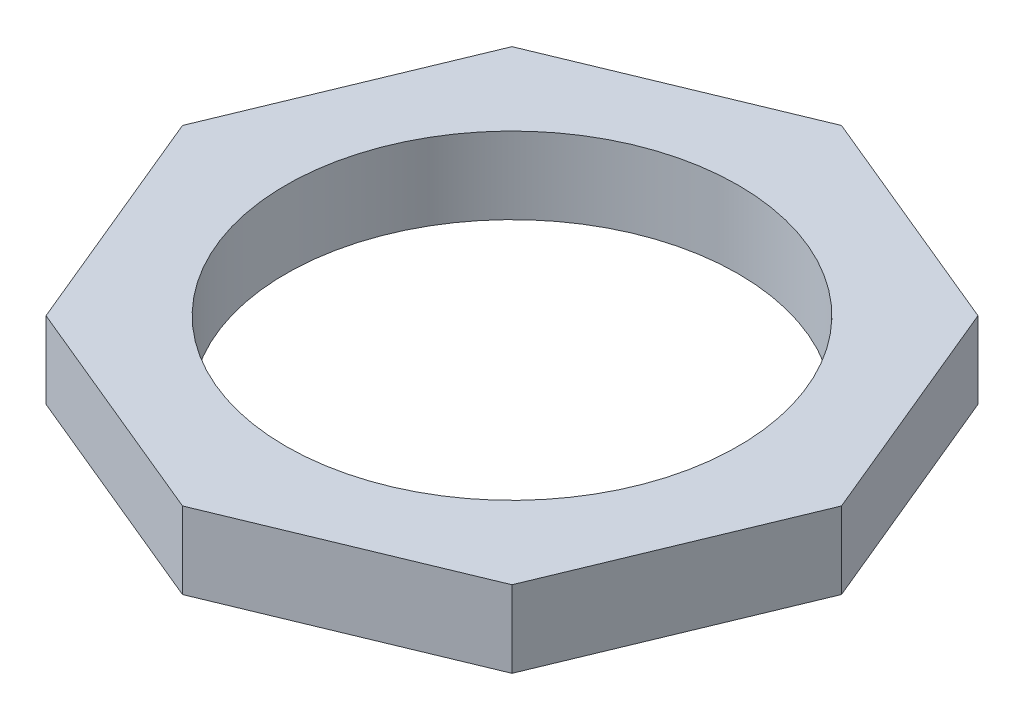
ISO-10303-21;
HEADER;
FILE_DESCRIPTION(('STEP AP214'),'2;1');
FILE_NAME('part.step','',(''),(''),'','','');
FILE_SCHEMA(('AUTOMOTIVE_DESIGN { 1 0 10303 214 1 1 1 1 }'));
ENDSEC;
DATA;
#1=APPLICATION_CONTEXT('core data for automotive mechanical design processes');
#2=APPLICATION_PROTOCOL_DEFINITION('international standard','automotive_design',2000,#1);
#3=PRODUCT_CONTEXT('',#1,'mechanical');
#4=PRODUCT('Part','Part','',(#3));
#5=PRODUCT_RELATED_PRODUCT_CATEGORY('part','',(#4));
#6=PRODUCT_DEFINITION_FORMATION('','',#4);
#7=PRODUCT_DEFINITION_CONTEXT('part definition',#1,'design');
#8=PRODUCT_DEFINITION('design','',#6,#7);
#9=PRODUCT_DEFINITION_SHAPE('','',#8);
#10=(LENGTH_UNIT() NAMED_UNIT(*) SI_UNIT(.MILLI.,.METRE.));
#11=(NAMED_UNIT(*) PLANE_ANGLE_UNIT() SI_UNIT($,.RADIAN.));
#12=(NAMED_UNIT(*) SI_UNIT($,.STERADIAN.) SOLID_ANGLE_UNIT());
#13=UNCERTAINTY_MEASURE_WITH_UNIT(LENGTH_MEASURE(1.E-05),#10,'distance_accuracy_value','');
#14=(GEOMETRIC_REPRESENTATION_CONTEXT(3) GLOBAL_UNCERTAINTY_ASSIGNED_CONTEXT((#13)) GLOBAL_UNIT_ASSIGNED_CONTEXT((#10,
#11,#12)) REPRESENTATION_CONTEXT('',''));
#15=CARTESIAN_POINT('',(0.,0.,0.));
#16=DIRECTION('',(0.,0.,1.));
#17=DIRECTION('',(1.,0.,0.));
#18=AXIS2_PLACEMENT_3D('',#15,#16,#17);
#19=CARTESIAN_POINT('',(0.,14.3,0.));
#20=DIRECTION('',(0.,1.,0.));
#21=DIRECTION('',(0.,0.,1.));
#22=AXIS2_PLACEMENT_3D('',#19,#20,#21);
#23=PLANE('',#22);
#24=DIRECTION('',(0.382683432365072,0.,-0.923879532511294));
#25=VECTOR('',#24,1.);
#26=CARTESIAN_POINT('',(43.4223380280315,14.3,39.9165208007097));
#27=LINE('',#26,#25);
#28=CARTESIAN_POINT('',(43.4223380280315,14.3,39.9165208007097));
#29=VERTEX_POINT('',#28);
#30=CARTESIAN_POINT('',(61.4084593491896,14.3,-3.50581722732055));
#31=VERTEX_POINT('',#30);
#32=EDGE_CURVE('E151',#29,#31,#27,.T.);
#33=ORIENTED_EDGE('',*,*,#32,.T.);
#34=DIRECTION('',(-0.38268343236509,0.,-0.923879532511286));
#35=VECTOR('',#34,1.);
#36=CARTESIAN_POINT('',(61.4084593491896,14.3,-3.50581722732055));
#37=LINE('',#36,#35);
#38=CARTESIAN_POINT('',(43.4223380280303,14.3,-46.9281552553511));
#39=VERTEX_POINT('',#38);
#40=EDGE_CURVE('E99',#31,#39,#37,.T.);
#41=ORIENTED_EDGE('',*,*,#40,.T.);
#42=DIRECTION('',(-0.92387953251129,0.,-0.382683432365081));
#43=VECTOR('',#42,1.);
#44=CARTESIAN_POINT('',(43.4223380280303,14.3,-46.9281552553511));
#45=LINE('',#44,#43);
#46=CARTESIAN_POINT('',(-9.74918016590928E-13,14.3,-64.9142765765101));
#47=VERTEX_POINT('',#46);
#48=EDGE_CURVE('E166',#39,#47,#45,.T.);
#49=ORIENTED_EDGE('',*,*,#48,.T.);
#50=DIRECTION('',(-0.923879532511282,0.,0.382683432365102));
#51=VECTOR('',#50,1.);
#52=CARTESIAN_POINT('',(-9.74918016590928E-13,14.3,-64.9142765765101));
#53=LINE('',#52,#51);
#54=CARTESIAN_POINT('',(-43.4223380280312,14.3,-46.9281552553504));
#55=VERTEX_POINT('',#54);
#56=EDGE_CURVE('E179',#47,#55,#53,.T.);
#57=ORIENTED_EDGE('',*,*,#56,.T.);
#58=DIRECTION('',(-0.382683432365082,0.,0.92387953251129));
#59=VECTOR('',#58,1.);
#60=CARTESIAN_POINT('',(-43.4223380280312,14.3,-46.9281552553504));
#61=LINE('',#60,#59);
#62=CARTESIAN_POINT('',(-61.4084593491898,14.3,-3.50581722732037));
#63=VERTEX_POINT('',#62);
#64=EDGE_CURVE('E118',#55,#63,#61,.T.);
#65=ORIENTED_EDGE('',*,*,#64,.T.);
#66=DIRECTION('',(0.382683432365091,0.,0.923879532511286));
#67=VECTOR('',#66,1.);
#68=CARTESIAN_POINT('',(-61.4084593491898,14.3,-3.50581722732037));
#69=LINE('',#68,#67);
#70=CARTESIAN_POINT('',(-43.4223380280305,14.3,39.9165208007101));
#71=VERTEX_POINT('',#70);
#72=EDGE_CURVE('E112',#63,#71,#69,.T.);
#73=ORIENTED_EDGE('',*,*,#72,.T.);
#74=DIRECTION('',(0.923879532511287,0.,0.38268343236509));
#75=VECTOR('',#74,1.);
#76=CARTESIAN_POINT('',(-43.4223380280305,14.3,39.9165208007101));
#77=LINE('',#76,#75);
#78=CARTESIAN_POINT('',(1.02401028136837E-12,14.3,57.9026421218698));
#79=VERTEX_POINT('',#78);
#80=EDGE_CURVE('E116',#71,#79,#77,.T.);
#81=ORIENTED_EDGE('',*,*,#80,.T.);
#82=DIRECTION('',(0.92387953251128,0.,-0.382683432365106));
#83=VECTOR('',#82,1.);
#84=CARTESIAN_POINT('',(1.02401028136837E-12,14.3,57.9026421218698));
#85=LINE('',#84,#83);
#86=EDGE_CURVE('E56',#79,#29,#85,.T.);
#87=ORIENTED_EDGE('',*,*,#86,.T.);
#88=EDGE_LOOP('',(#33,#41,#49,#57,#65,#73,#81,#87));
#89=FACE_BOUND('',#88,.T.);
#90=CARTESIAN_POINT('',(0.,14.3,-3.50581722732024));
#91=DIRECTION('',(0.,1.,0.));
#92=DIRECTION('',(0.,0.,1.));
#93=AXIS2_PLACEMENT_3D('',#90,#91,#92);
#94=CIRCLE('',#93,42.15);
#95=CARTESIAN_POINT('',(0.,14.3,38.6441827726798));
#96=VERTEX_POINT('',#95);
#97=EDGE_CURVE('E140',#96,#96,#94,.T.);
#98=ORIENTED_EDGE('',*,*,#97,.F.);
#99=EDGE_LOOP('',(#98));
#100=FACE_BOUND('',#99,.T.);
#101=ADVANCED_FACE('F39',(#89,#100),#23,.T.);
#102=CARTESIAN_POINT('',(0.,0.,0.));
#103=DIRECTION('',(0.,1.,0.));
#104=DIRECTION('',(0.,0.,1.));
#105=AXIS2_PLACEMENT_3D('',#102,#103,#104);
#106=PLANE('',#105);
#107=DIRECTION('',(0.382683432365072,0.,-0.923879532511294));
#108=VECTOR('',#107,1.);
#109=CARTESIAN_POINT('',(43.4223380280315,0.,39.9165208007097));
#110=LINE('',#109,#108);
#111=CARTESIAN_POINT('',(43.4223380280315,0.,39.9165208007097));
#112=VERTEX_POINT('',#111);
#113=CARTESIAN_POINT('',(61.4084593491896,0.,-3.50581722732055));
#114=VERTEX_POINT('',#113);
#115=EDGE_CURVE('E136',#112,#114,#110,.T.);
#116=ORIENTED_EDGE('',*,*,#115,.F.);
#117=DIRECTION('',(0.92387953251128,0.,-0.382683432365106));
#118=VECTOR('',#117,1.);
#119=CARTESIAN_POINT('',(1.02401028136837E-12,0.,57.9026421218698));
#120=LINE('',#119,#118);
#121=CARTESIAN_POINT('',(1.02401028136837E-12,0.,57.9026421218698));
#122=VERTEX_POINT('',#121);
#123=EDGE_CURVE('E91',#122,#112,#120,.T.);
#124=ORIENTED_EDGE('',*,*,#123,.F.);
#125=DIRECTION('',(0.923879532511287,0.,0.38268343236509));
#126=VECTOR('',#125,1.);
#127=CARTESIAN_POINT('',(-43.4223380280305,0.,39.9165208007101));
#128=LINE('',#127,#126);
#129=CARTESIAN_POINT('',(-43.4223380280305,0.,39.9165208007101));
#130=VERTEX_POINT('',#129);
#131=EDGE_CURVE('E85',#130,#122,#128,.T.);
#132=ORIENTED_EDGE('',*,*,#131,.F.);
#133=DIRECTION('',(0.382683432365091,0.,0.923879532511286));
#134=VECTOR('',#133,1.);
#135=CARTESIAN_POINT('',(-61.4084593491898,0.,-3.50581722732037));
#136=LINE('',#135,#134);
#137=CARTESIAN_POINT('',(-61.4084593491898,0.,-3.50581722732037));
#138=VERTEX_POINT('',#137);
#139=EDGE_CURVE('E126',#138,#130,#136,.T.);
#140=ORIENTED_EDGE('',*,*,#139,.F.);
#141=DIRECTION('',(-0.382683432365082,0.,0.92387953251129));
#142=VECTOR('',#141,1.);
#143=CARTESIAN_POINT('',(-43.4223380280312,0.,-46.9281552553504));
#144=LINE('',#143,#142);
#145=CARTESIAN_POINT('',(-43.4223380280312,0.,-46.9281552553504));
#146=VERTEX_POINT('',#145);
#147=EDGE_CURVE('E146',#146,#138,#144,.T.);
#148=ORIENTED_EDGE('',*,*,#147,.F.);
#149=DIRECTION('',(-0.923879532511282,0.,0.382683432365102));
#150=VECTOR('',#149,1.);
#151=CARTESIAN_POINT('',(-9.74918016590928E-13,0.,-64.9142765765101));
#152=LINE('',#151,#150);
#153=CARTESIAN_POINT('',(-9.74918016590928E-13,0.,-64.9142765765101));
#154=VERTEX_POINT('',#153);
#155=EDGE_CURVE('E144',#154,#146,#152,.T.);
#156=ORIENTED_EDGE('',*,*,#155,.F.);
#157=DIRECTION('',(-0.92387953251129,0.,-0.382683432365081));
#158=VECTOR('',#157,1.);
#159=CARTESIAN_POINT('',(43.4223380280303,0.,-46.9281552553511));
#160=LINE('',#159,#158);
#161=CARTESIAN_POINT('',(43.4223380280303,0.,-46.9281552553511));
#162=VERTEX_POINT('',#161);
#163=EDGE_CURVE('E142',#162,#154,#160,.T.);
#164=ORIENTED_EDGE('',*,*,#163,.F.);
#165=DIRECTION('',(-0.38268343236509,0.,-0.923879532511286));
#166=VECTOR('',#165,1.);
#167=CARTESIAN_POINT('',(61.4084593491896,0.,-3.50581722732055));
#168=LINE('',#167,#166);
#169=EDGE_CURVE('E139',#114,#162,#168,.T.);
#170=ORIENTED_EDGE('',*,*,#169,.F.);
#171=EDGE_LOOP('',(#116,#124,#132,#140,#148,#156,#164,#170));
#172=FACE_BOUND('',#171,.T.);
#173=CARTESIAN_POINT('',(0.,0.,-3.50581722732024));
#174=DIRECTION('',(0.,1.,0.));
#175=DIRECTION('',(0.,0.,1.));
#176=AXIS2_PLACEMENT_3D('',#173,#174,#175);
#177=CIRCLE('',#176,42.15);
#178=CARTESIAN_POINT('',(0.,0.,38.6441827726798));
#179=VERTEX_POINT('',#178);
#180=EDGE_CURVE('E185',#179,#179,#177,.T.);
#181=ORIENTED_EDGE('',*,*,#180,.T.);
#182=EDGE_LOOP('',(#181));
#183=FACE_BOUND('',#182,.T.);
#184=ADVANCED_FACE('F170',(#172,#183),#106,.F.);
#185=CARTESIAN_POINT('',(43.4223380280315,14.3,39.9165208007097));
#186=DIRECTION('',(-0.923879532511294,0.,-0.382683432365072));
#187=DIRECTION('',(-0.382683432365072,0.,0.923879532511294));
#188=AXIS2_PLACEMENT_3D('',#185,#186,#187);
#189=PLANE('',#188);
#190=ORIENTED_EDGE('',*,*,#115,.T.);
#191=DIRECTION('',(0.,-1.,0.));
#192=VECTOR('',#191,1.);
#193=CARTESIAN_POINT('',(61.4084593491896,14.3,-3.50581722732055));
#194=LINE('',#193,#192);
#195=EDGE_CURVE('E11',#31,#114,#194,.T.);
#196=ORIENTED_EDGE('',*,*,#195,.F.);
#197=ORIENTED_EDGE('',*,*,#32,.F.);
#198=DIRECTION('',(0.,-1.,0.));
#199=VECTOR('',#198,1.);
#200=CARTESIAN_POINT('',(43.4223380280315,14.3,39.9165208007097));
#201=LINE('',#200,#199);
#202=EDGE_CURVE('E132',#29,#112,#201,.T.);
#203=ORIENTED_EDGE('',*,*,#202,.T.);
#204=EDGE_LOOP('',(#190,#196,#197,#203));
#205=FACE_BOUND('',#204,.T.);
#206=ADVANCED_FACE('F41',(#205),#189,.F.);
#207=CARTESIAN_POINT('',(61.4084593491896,14.3,-3.50581722732055));
#208=DIRECTION('',(-0.923879532511287,0.,0.382683432365091));
#209=DIRECTION('',(0.382683432365091,0.,0.923879532511287));
#210=AXIS2_PLACEMENT_3D('',#207,#208,#209);
#211=PLANE('',#210);
#212=ORIENTED_EDGE('',*,*,#169,.T.);
#213=DIRECTION('',(0.,-1.,0.));
#214=VECTOR('',#213,1.);
#215=CARTESIAN_POINT('',(43.4223380280303,14.3,-46.9281552553511));
#216=LINE('',#215,#214);
#217=EDGE_CURVE('E48',#39,#162,#216,.T.);
#218=ORIENTED_EDGE('',*,*,#217,.F.);
#219=ORIENTED_EDGE('',*,*,#40,.F.);
#220=ORIENTED_EDGE('',*,*,#195,.T.);
#221=EDGE_LOOP('',(#212,#218,#219,#220));
#222=FACE_BOUND('',#221,.T.);
#223=ADVANCED_FACE('F213',(#222),#211,.F.);
#224=CARTESIAN_POINT('',(43.4223380280303,14.3,-46.9281552553511));
#225=DIRECTION('',(-0.382683432365081,0.,0.92387953251129));
#226=DIRECTION('',(0.923879532511291,0.,0.382683432365081));
#227=AXIS2_PLACEMENT_3D('',#224,#225,#226);
#228=PLANE('',#227);
#229=ORIENTED_EDGE('',*,*,#163,.T.);
#230=DIRECTION('',(0.,-1.,0.));
#231=VECTOR('',#230,1.);
#232=CARTESIAN_POINT('',(-9.74918016590928E-13,14.3,-64.9142765765101));
#233=LINE('',#232,#231);
#234=EDGE_CURVE('E158',#47,#154,#233,.T.);
#235=ORIENTED_EDGE('',*,*,#234,.F.);
#236=ORIENTED_EDGE('',*,*,#48,.F.);
#237=ORIENTED_EDGE('',*,*,#217,.T.);
#238=EDGE_LOOP('',(#229,#235,#236,#237));
#239=FACE_BOUND('',#238,.T.);
#240=ADVANCED_FACE('F164',(#239),#228,.F.);
#241=CARTESIAN_POINT('',(-9.74918016590928E-13,14.3,-64.9142765765101));
#242=DIRECTION('',(0.382683432365102,0.,0.923879532511282));
#243=DIRECTION('',(0.923879532511282,0.,-0.382683432365102));
#244=AXIS2_PLACEMENT_3D('',#241,#242,#243);
#245=PLANE('',#244);
#246=ORIENTED_EDGE('',*,*,#155,.T.);
#247=DIRECTION('',(0.,-1.,0.));
#248=VECTOR('',#247,1.);
#249=CARTESIAN_POINT('',(-43.4223380280312,14.3,-46.9281552553504));
#250=LINE('',#249,#248);
#251=EDGE_CURVE('E155',#55,#146,#250,.T.);
#252=ORIENTED_EDGE('',*,*,#251,.F.);
#253=ORIENTED_EDGE('',*,*,#56,.F.);
#254=ORIENTED_EDGE('',*,*,#234,.T.);
#255=EDGE_LOOP('',(#246,#252,#253,#254));
#256=FACE_BOUND('',#255,.T.);
#257=ADVANCED_FACE('F175',(#256),#245,.F.);
#258=CARTESIAN_POINT('',(-43.4223380280312,14.3,-46.9281552553504));
#259=DIRECTION('',(0.92387953251129,0.,0.382683432365082));
#260=DIRECTION('',(0.382683432365082,0.,-0.92387953251129));
#261=AXIS2_PLACEMENT_3D('',#258,#259,#260);
#262=PLANE('',#261);
#263=ORIENTED_EDGE('',*,*,#147,.T.);
#264=DIRECTION('',(0.,-1.,0.));
#265=VECTOR('',#264,1.);
#266=CARTESIAN_POINT('',(-61.4084593491898,14.3,-3.50581722732037));
#267=LINE('',#266,#265);
#268=EDGE_CURVE('E127',#63,#138,#267,.T.);
#269=ORIENTED_EDGE('',*,*,#268,.F.);
#270=ORIENTED_EDGE('',*,*,#64,.F.);
#271=ORIENTED_EDGE('',*,*,#251,.T.);
#272=EDGE_LOOP('',(#263,#269,#270,#271));
#273=FACE_BOUND('',#272,.T.);
#274=ADVANCED_FACE('F178',(#273),#262,.F.);
#275=CARTESIAN_POINT('',(-61.4084593491898,14.3,-3.50581722732037));
#276=DIRECTION('',(0.923879532511286,0.,-0.382683432365091));
#277=DIRECTION('',(-0.382683432365091,0.,-0.923879532511286));
#278=AXIS2_PLACEMENT_3D('',#275,#276,#277);
#279=PLANE('',#278);
#280=ORIENTED_EDGE('',*,*,#139,.T.);
#281=DIRECTION('',(0.,-1.,0.));
#282=VECTOR('',#281,1.);
#283=CARTESIAN_POINT('',(-43.4223380280305,14.3,39.9165208007101));
#284=LINE('',#283,#282);
#285=EDGE_CURVE('E123',#71,#130,#284,.T.);
#286=ORIENTED_EDGE('',*,*,#285,.F.);
#287=ORIENTED_EDGE('',*,*,#72,.F.);
#288=ORIENTED_EDGE('',*,*,#268,.T.);
#289=EDGE_LOOP('',(#280,#286,#287,#288));
#290=FACE_BOUND('',#289,.T.);
#291=ADVANCED_FACE('F124',(#290),#279,.F.);
#292=CARTESIAN_POINT('',(-43.4223380280305,14.3,39.9165208007101));
#293=DIRECTION('',(0.38268343236509,0.,-0.923879532511287));
#294=DIRECTION('',(-0.923879532511287,0.,-0.38268343236509));
#295=AXIS2_PLACEMENT_3D('',#292,#293,#294);
#296=PLANE('',#295);
#297=ORIENTED_EDGE('',*,*,#131,.T.);
#298=DIRECTION('',(0.,-1.,0.));
#299=VECTOR('',#298,1.);
#300=CARTESIAN_POINT('',(1.02401028136837E-12,14.3,57.9026421218698));
#301=LINE('',#300,#299);
#302=EDGE_CURVE('E128',#79,#122,#301,.T.);
#303=ORIENTED_EDGE('',*,*,#302,.F.);
#304=ORIENTED_EDGE('',*,*,#80,.F.);
#305=ORIENTED_EDGE('',*,*,#285,.T.);
#306=EDGE_LOOP('',(#297,#303,#304,#305));
#307=FACE_BOUND('',#306,.T.);
#308=ADVANCED_FACE('F130',(#307),#296,.F.);
#309=CARTESIAN_POINT('',(1.02401028136837E-12,14.3,57.9026421218698));
#310=DIRECTION('',(-0.382683432365106,0.,-0.92387953251128));
#311=DIRECTION('',(-0.92387953251128,0.,0.382683432365106));
#312=AXIS2_PLACEMENT_3D('',#309,#310,#311);
#313=PLANE('',#312);
#314=ORIENTED_EDGE('',*,*,#123,.T.);
#315=ORIENTED_EDGE('',*,*,#202,.F.);
#316=ORIENTED_EDGE('',*,*,#86,.F.);
#317=ORIENTED_EDGE('',*,*,#302,.T.);
#318=EDGE_LOOP('',(#314,#315,#316,#317));
#319=FACE_BOUND('',#318,.T.);
#320=ADVANCED_FACE('F201',(#319),#313,.F.);
#321=CARTESIAN_POINT('',(0.,14.3,-3.50581722732024));
#322=DIRECTION('',(0.,-1.,0.));
#323=DIRECTION('',(0.,0.,-1.));
#324=AXIS2_PLACEMENT_3D('',#321,#322,#323);
#325=CYLINDRICAL_SURFACE('',#324,42.15);
#326=ORIENTED_EDGE('',*,*,#97,.T.);
#327=EDGE_LOOP('',(#326));
#328=FACE_BOUND('',#327,.T.);
#329=ORIENTED_EDGE('',*,*,#180,.F.);
#330=EDGE_LOOP('',(#329));
#331=FACE_BOUND('',#330,.T.);
#332=ADVANCED_FACE('F191',(#328,#331),#325,.F.);
#333=CLOSED_SHELL('',(#101,#184,#206,#223,#240,#257,#274,#291,#308,#320,#332));
#334=MANIFOLD_SOLID_BREP('B2',#333);
#335=ADVANCED_BREP_SHAPE_REPRESENTATION('',(#18,#334),#14);
#336=SHAPE_DEFINITION_REPRESENTATION(#9,#335);
ENDSEC;
END-ISO-10303-21;
